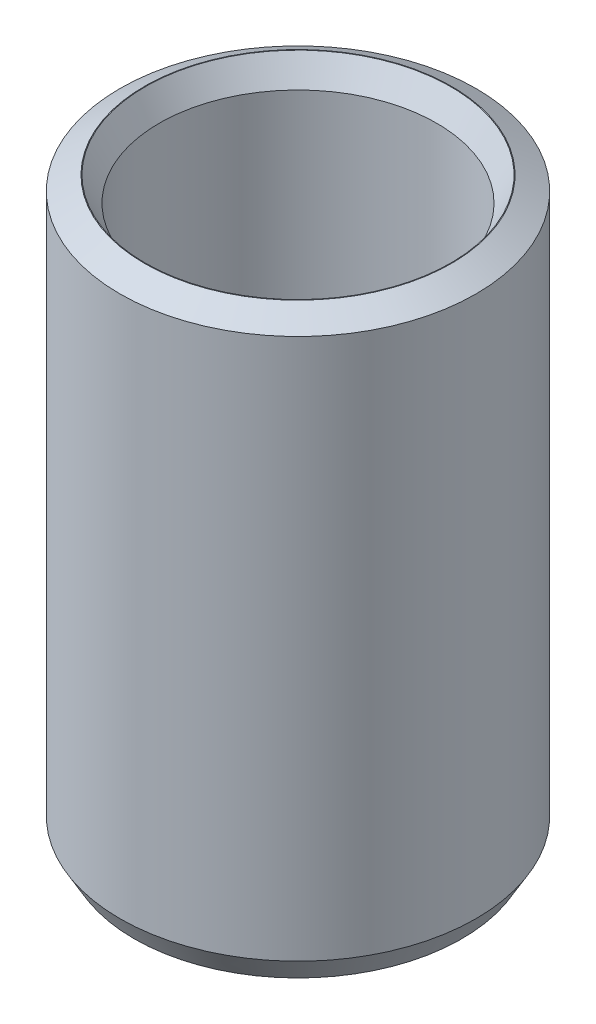
ISO-10303-21;
HEADER;
FILE_DESCRIPTION(('STEP AP214'),'2;1');
FILE_NAME('part.step','',(''),(''),'','','');
FILE_SCHEMA(('AUTOMOTIVE_DESIGN { 1 0 10303 214 1 1 1 1 }'));
ENDSEC;
DATA;
#1=APPLICATION_CONTEXT('core data for automotive mechanical design processes');
#2=APPLICATION_PROTOCOL_DEFINITION('international standard','automotive_design',2000,#1);
#3=PRODUCT_CONTEXT('',#1,'mechanical');
#4=PRODUCT('Part','Part','',(#3));
#5=PRODUCT_RELATED_PRODUCT_CATEGORY('part','',(#4));
#6=PRODUCT_DEFINITION_FORMATION('','',#4);
#7=PRODUCT_DEFINITION_CONTEXT('part definition',#1,'design');
#8=PRODUCT_DEFINITION('design','',#6,#7);
#9=PRODUCT_DEFINITION_SHAPE('','',#8);
#10=(LENGTH_UNIT() NAMED_UNIT(*) SI_UNIT(.MILLI.,.METRE.));
#11=(NAMED_UNIT(*) PLANE_ANGLE_UNIT() SI_UNIT($,.RADIAN.));
#12=(NAMED_UNIT(*) SI_UNIT($,.STERADIAN.) SOLID_ANGLE_UNIT());
#13=UNCERTAINTY_MEASURE_WITH_UNIT(LENGTH_MEASURE(1.E-05),#10,'distance_accuracy_value','');
#14=(GEOMETRIC_REPRESENTATION_CONTEXT(3) GLOBAL_UNCERTAINTY_ASSIGNED_CONTEXT((#13)) GLOBAL_UNIT_ASSIGNED_CONTEXT((#10,
#11,#12)) REPRESENTATION_CONTEXT('',''));
#15=CARTESIAN_POINT('',(0.,0.,0.));
#16=DIRECTION('',(0.,0.,1.));
#17=DIRECTION('',(1.,0.,0.));
#18=AXIS2_PLACEMENT_3D('',#15,#16,#17);
#19=CARTESIAN_POINT('',(0.,97.7055342181677,0.));
#20=DIRECTION('',(0.,-1.,0.));
#21=DIRECTION('',(0.,0.,-1.));
#22=AXIS2_PLACEMENT_3D('',#19,#20,#21);
#23=CYLINDRICAL_SURFACE('',#22,30.);
#24=CARTESIAN_POINT('',(0.,4.12972663439809,0.));
#25=DIRECTION('',(0.,1.,0.));
#26=DIRECTION('',(0.,0.,1.));
#27=AXIS2_PLACEMENT_3D('',#24,#25,#26);
#28=CIRCLE('',#27,30.);
#29=CARTESIAN_POINT('',(0.,4.12972663439809,30.));
#30=VERTEX_POINT('',#29);
#31=EDGE_CURVE('E10',#30,#30,#28,.T.);
#32=ORIENTED_EDGE('',*,*,#31,.T.);
#33=EDGE_LOOP('',(#32));
#34=FACE_BOUND('',#33,.T.);
#35=CARTESIAN_POINT('',(0.,95.3212354341183,0.));
#36=DIRECTION('',(0.,1.,0.));
#37=DIRECTION('',(0.,0.,1.));
#38=AXIS2_PLACEMENT_3D('',#35,#36,#37);
#39=CIRCLE('',#38,30.);
#40=CARTESIAN_POINT('',(0.,95.3212354341183,30.));
#41=VERTEX_POINT('',#40);
#42=EDGE_CURVE('E50',#41,#41,#39,.F.);
#43=ORIENTED_EDGE('',*,*,#42,.T.);
#44=EDGE_LOOP('',(#43));
#45=FACE_BOUND('',#44,.T.);
#46=ADVANCED_FACE('F39',(#34,#45),#23,.T.);
#47=CARTESIAN_POINT('',(0.,97.7055342181677,0.));
#48=DIRECTION('',(0.,1.,0.));
#49=DIRECTION('',(0.,0.,1.));
#50=AXIS2_PLACEMENT_3D('',#47,#48,#49);
#51=PLANE('',#50);
#52=CARTESIAN_POINT('',(0.,97.7055342181677,0.));
#53=DIRECTION('',(0.,1.,0.));
#54=DIRECTION('',(0.,0.,1.));
#55=AXIS2_PLACEMENT_3D('',#52,#53,#54);
#56=CIRCLE('',#55,25.7524163392628);
#57=CARTESIAN_POINT('',(0.,97.7055342181677,25.7524163392628));
#58=VERTEX_POINT('',#57);
#59=EDGE_CURVE('E58',#58,#58,#56,.F.);
#60=ORIENTED_EDGE('',*,*,#59,.T.);
#61=EDGE_LOOP('',(#60));
#62=FACE_BOUND('',#61,.T.);
#63=CARTESIAN_POINT('',(0.,97.7055342181677,0.));
#64=DIRECTION('',(0.,1.,0.));
#65=DIRECTION('',(0.,0.,1.));
#66=AXIS2_PLACEMENT_3D('',#63,#64,#65);
#67=CIRCLE('',#66,25.8702733656019);
#68=CARTESIAN_POINT('',(0.,97.7055342181677,25.8702733656019));
#69=VERTEX_POINT('',#68);
#70=EDGE_CURVE('E61',#69,#69,#67,.T.);
#71=ORIENTED_EDGE('',*,*,#70,.T.);
#72=EDGE_LOOP('',(#71));
#73=FACE_BOUND('',#72,.T.);
#74=ADVANCED_FACE('F88',(#62,#73),#51,.T.);
#75=CARTESIAN_POINT('',(0.,0.,0.));
#76=DIRECTION('',(0.,1.,0.));
#77=DIRECTION('',(0.,0.,1.));
#78=AXIS2_PLACEMENT_3D('',#75,#76,#77);
#79=PLANE('',#78);
#80=CARTESIAN_POINT('',(0.,0.,0.));
#81=DIRECTION('',(0.,1.,0.));
#82=DIRECTION('',(0.,0.,1.));
#83=AXIS2_PLACEMENT_3D('',#80,#81,#82);
#84=CIRCLE('',#83,27.4978441896115);
#85=CARTESIAN_POINT('',(0.,0.,27.4978441896115));
#86=VERTEX_POINT('',#85);
#87=EDGE_CURVE('E51',#86,#86,#84,.T.);
#88=ORIENTED_EDGE('',*,*,#87,.T.);
#89=EDGE_LOOP('',(#88));
#90=FACE_BOUND('',#89,.T.);
#91=CARTESIAN_POINT('',(0.,0.,0.));
#92=DIRECTION('',(0.,1.,0.));
#93=DIRECTION('',(0.,0.,1.));
#94=AXIS2_PLACEMENT_3D('',#91,#92,#93);
#95=CIRCLE('',#94,27.6157012159507);
#96=CARTESIAN_POINT('',(0.,0.,27.6157012159507));
#97=VERTEX_POINT('',#96);
#98=EDGE_CURVE('E54',#97,#97,#95,.F.);
#99=ORIENTED_EDGE('',*,*,#98,.T.);
#100=EDGE_LOOP('',(#99));
#101=FACE_BOUND('',#100,.T.);
#102=ADVANCED_FACE('F83',(#90,#101),#79,.F.);
#103=CARTESIAN_POINT('',(0.,97.7055342181677,0.));
#104=DIRECTION('',(0.,-1.,0.));
#105=DIRECTION('',(0.,0.,-1.));
#106=AXIS2_PLACEMENT_3D('',#103,#104,#105);
#107=CYLINDRICAL_SURFACE('',#106,23.3681175552135);
#108=CARTESIAN_POINT('',(0.,93.5758075837696,0.));
#109=DIRECTION('',(0.,1.,0.));
#110=DIRECTION('',(0.,0.,1.));
#111=AXIS2_PLACEMENT_3D('',#108,#109,#110);
#112=CIRCLE('',#111,23.3681175552135);
#113=CARTESIAN_POINT('',(0.,93.5758075837696,23.3681175552135));
#114=VERTEX_POINT('',#113);
#115=EDGE_CURVE('E67',#114,#114,#112,.T.);
#116=ORIENTED_EDGE('',*,*,#115,.T.);
#117=EDGE_LOOP('',(#116));
#118=FACE_BOUND('',#117,.T.);
#119=CARTESIAN_POINT('',(0.,2.38429878404932,0.));
#120=DIRECTION('',(0.,1.,0.));
#121=DIRECTION('',(0.,0.,1.));
#122=AXIS2_PLACEMENT_3D('',#119,#120,#121);
#123=CIRCLE('',#122,23.3681175552135);
#124=CARTESIAN_POINT('',(0.,2.38429878404932,23.3681175552135));
#125=VERTEX_POINT('',#124);
#126=EDGE_CURVE('E69',#125,#125,#123,.F.);
#127=ORIENTED_EDGE('',*,*,#126,.T.);
#128=EDGE_LOOP('',(#127));
#129=FACE_BOUND('',#128,.T.);
#130=ADVANCED_FACE('F71',(#118,#129),#107,.F.);
#131=CARTESIAN_POINT('',(0.,93.5758075837696,0.));
#132=DIRECTION('',(0.,1.,0.));
#133=DIRECTION('',(0.,0.,1.));
#134=AXIS2_PLACEMENT_3D('',#131,#132,#133);
#135=CONICAL_SURFACE('',#134,23.3681175552135,0.523598775598304);
#136=ORIENTED_EDGE('',*,*,#59,.F.);
#137=EDGE_LOOP('',(#136));
#138=FACE_BOUND('',#137,.T.);
#139=ORIENTED_EDGE('',*,*,#115,.F.);
#140=EDGE_LOOP('',(#139));
#141=FACE_BOUND('',#140,.T.);
#142=ADVANCED_FACE('F77',(#138,#141),#135,.F.);
#143=CARTESIAN_POINT('',(0.,0.,0.));
#144=DIRECTION('',(0.,-1.,0.));
#145=DIRECTION('',(0.,0.,-1.));
#146=AXIS2_PLACEMENT_3D('',#143,#144,#145);
#147=CONICAL_SURFACE('',#146,27.4978441896115,1.04719755119659);
#148=ORIENTED_EDGE('',*,*,#126,.F.);
#149=EDGE_LOOP('',(#148));
#150=FACE_BOUND('',#149,.T.);
#151=ORIENTED_EDGE('',*,*,#87,.F.);
#152=EDGE_LOOP('',(#151));
#153=FACE_BOUND('',#152,.T.);
#154=ADVANCED_FACE('F73',(#150,#153),#147,.F.);
#155=CARTESIAN_POINT('',(0.,4.12972663439809,0.));
#156=DIRECTION('',(0.,1.,0.));
#157=DIRECTION('',(0.,0.,1.));
#158=AXIS2_PLACEMENT_3D('',#155,#156,#157);
#159=CONICAL_SURFACE('',#158,30.,0.523598775598303);
#160=ORIENTED_EDGE('',*,*,#98,.F.);
#161=EDGE_LOOP('',(#160));
#162=FACE_BOUND('',#161,.T.);
#163=ORIENTED_EDGE('',*,*,#31,.F.);
#164=EDGE_LOOP('',(#163));
#165=FACE_BOUND('',#164,.T.);
#166=ADVANCED_FACE('F76',(#162,#165),#159,.T.);
#167=CARTESIAN_POINT('',(0.,97.7055342181677,0.));
#168=DIRECTION('',(0.,-1.,0.));
#169=DIRECTION('',(0.,0.,-1.));
#170=AXIS2_PLACEMENT_3D('',#167,#168,#169);
#171=CONICAL_SURFACE('',#170,25.8702733656019,1.04719755119659);
#172=ORIENTED_EDGE('',*,*,#42,.F.);
#173=EDGE_LOOP('',(#172));
#174=FACE_BOUND('',#173,.T.);
#175=ORIENTED_EDGE('',*,*,#70,.F.);
#176=EDGE_LOOP('',(#175));
#177=FACE_BOUND('',#176,.T.);
#178=ADVANCED_FACE('F45',(#174,#177),#171,.T.);
#179=CLOSED_SHELL('',(#46,#74,#102,#130,#142,#154,#166,#178));
#180=MANIFOLD_SOLID_BREP('B2',#179);
#181=ADVANCED_BREP_SHAPE_REPRESENTATION('',(#18,#180),#14);
#182=SHAPE_DEFINITION_REPRESENTATION(#9,#181);
ENDSEC;
END-ISO-10303-21;
